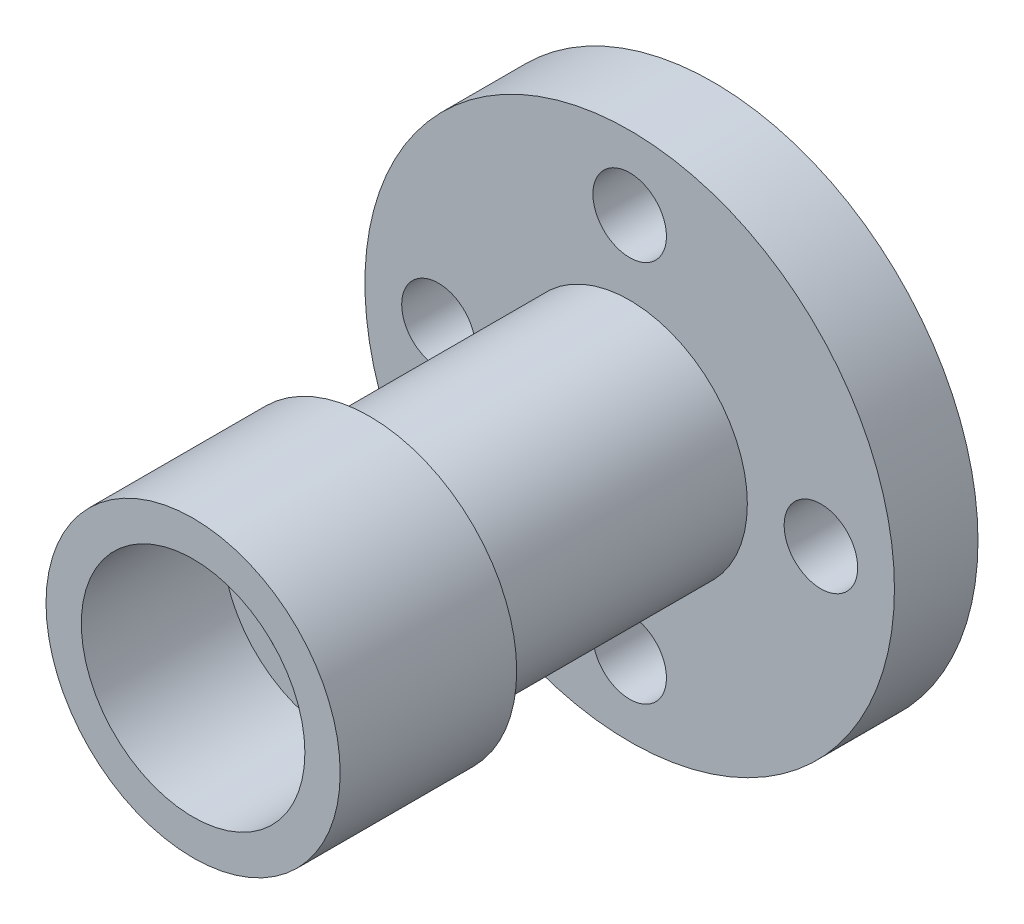
ISO-10303-21;
HEADER;
FILE_DESCRIPTION(('STEP AP214'),'2;1');
FILE_NAME('part.step','',(''),(''),'','','');
FILE_SCHEMA(('AUTOMOTIVE_DESIGN { 1 0 10303 214 1 1 1 1 }'));
ENDSEC;
DATA;
#1=APPLICATION_CONTEXT('core data for automotive mechanical design processes');
#2=APPLICATION_PROTOCOL_DEFINITION('international standard','automotive_design',2000,#1);
#3=PRODUCT_CONTEXT('',#1,'mechanical');
#4=PRODUCT('Part','Part','',(#3));
#5=PRODUCT_RELATED_PRODUCT_CATEGORY('part','',(#4));
#6=PRODUCT_DEFINITION_FORMATION('','',#4);
#7=PRODUCT_DEFINITION_CONTEXT('part definition',#1,'design');
#8=PRODUCT_DEFINITION('design','',#6,#7);
#9=PRODUCT_DEFINITION_SHAPE('','',#8);
#10=(LENGTH_UNIT() NAMED_UNIT(*) SI_UNIT(.MILLI.,.METRE.));
#11=(NAMED_UNIT(*) PLANE_ANGLE_UNIT() SI_UNIT($,.RADIAN.));
#12=(NAMED_UNIT(*) SI_UNIT($,.STERADIAN.) SOLID_ANGLE_UNIT());
#13=UNCERTAINTY_MEASURE_WITH_UNIT(LENGTH_MEASURE(1.E-05),#10,'distance_accuracy_value','');
#14=(GEOMETRIC_REPRESENTATION_CONTEXT(3) GLOBAL_UNCERTAINTY_ASSIGNED_CONTEXT((#13)) GLOBAL_UNIT_ASSIGNED_CONTEXT((#10,
#11,#12)) REPRESENTATION_CONTEXT('',''));
#15=CARTESIAN_POINT('',(0.,0.,0.));
#16=DIRECTION('',(0.,0.,1.));
#17=DIRECTION('',(1.,0.,0.));
#18=AXIS2_PLACEMENT_3D('',#15,#16,#17);
#19=CARTESIAN_POINT('',(0.,0.,14.2));
#20=DIRECTION('',(0.,0.,-1.));
#21=DIRECTION('',(-1.,0.,0.));
#22=AXIS2_PLACEMENT_3D('',#19,#20,#21);
#23=CYLINDRICAL_SURFACE('',#22,45.);
#24=CARTESIAN_POINT('',(0.,0.,14.2));
#25=DIRECTION('',(0.,0.,1.));
#26=DIRECTION('',(1.,0.,0.));
#27=AXIS2_PLACEMENT_3D('',#24,#25,#26);
#28=CIRCLE('',#27,45.);
#29=CARTESIAN_POINT('',(45.,0.,14.2));
#30=VERTEX_POINT('',#29);
#31=EDGE_CURVE('E59',#30,#30,#28,.T.);
#32=ORIENTED_EDGE('',*,*,#31,.F.);
#33=EDGE_LOOP('',(#32));
#34=FACE_BOUND('',#33,.T.);
#35=CARTESIAN_POINT('',(0.,0.,0.));
#36=DIRECTION('',(0.,0.,1.));
#37=DIRECTION('',(1.,0.,0.));
#38=AXIS2_PLACEMENT_3D('',#35,#36,#37);
#39=CIRCLE('',#38,45.);
#40=CARTESIAN_POINT('',(45.,0.,0.));
#41=VERTEX_POINT('',#40);
#42=EDGE_CURVE('E62',#41,#41,#39,.T.);
#43=ORIENTED_EDGE('',*,*,#42,.T.);
#44=EDGE_LOOP('',(#43));
#45=FACE_BOUND('',#44,.T.);
#46=ADVANCED_FACE('F43',(#34,#45),#23,.T.);
#47=CARTESIAN_POINT('',(0.,0.,14.2));
#48=DIRECTION('',(0.,0.,1.));
#49=DIRECTION('',(1.,0.,0.));
#50=AXIS2_PLACEMENT_3D('',#47,#48,#49);
#51=PLANE('',#50);
#52=CARTESIAN_POINT('',(0.,32.5,14.2));
#53=DIRECTION('',(0.,0.,1.));
#54=DIRECTION('',(1.,0.,0.));
#55=AXIS2_PLACEMENT_3D('',#52,#53,#54);
#56=CIRCLE('',#55,6.25);
#57=CARTESIAN_POINT('',(6.25,32.5,14.2));
#58=VERTEX_POINT('',#57);
#59=EDGE_CURVE('E85',#58,#58,#56,.T.);
#60=ORIENTED_EDGE('',*,*,#59,.F.);
#61=EDGE_LOOP('',(#60));
#62=FACE_BOUND('',#61,.T.);
#63=CARTESIAN_POINT('',(-32.5,-1.13473143512402E-13,14.2));
#64=DIRECTION('',(0.,0.,1.));
#65=DIRECTION('',(1.,0.,0.));
#66=AXIS2_PLACEMENT_3D('',#63,#64,#65);
#67=CIRCLE('',#66,6.25);
#68=CARTESIAN_POINT('',(-26.25,-1.13473143512402E-13,14.2));
#69=VERTEX_POINT('',#68);
#70=EDGE_CURVE('E88',#69,#69,#67,.T.);
#71=ORIENTED_EDGE('',*,*,#70,.F.);
#72=EDGE_LOOP('',(#71));
#73=FACE_BOUND('',#72,.T.);
#74=CARTESIAN_POINT('',(2.26946287024804E-13,-32.5,14.2));
#75=DIRECTION('',(0.,0.,1.));
#76=DIRECTION('',(1.,0.,0.));
#77=AXIS2_PLACEMENT_3D('',#74,#75,#76);
#78=CIRCLE('',#77,6.25);
#79=CARTESIAN_POINT('',(6.25000000000023,-32.5,14.2));
#80=VERTEX_POINT('',#79);
#81=EDGE_CURVE('E91',#80,#80,#78,.T.);
#82=ORIENTED_EDGE('',*,*,#81,.F.);
#83=EDGE_LOOP('',(#82));
#84=FACE_BOUND('',#83,.T.);
#85=CARTESIAN_POINT('',(32.5,3.40419430537206E-13,14.2));
#86=DIRECTION('',(0.,0.,1.));
#87=DIRECTION('',(1.,0.,0.));
#88=AXIS2_PLACEMENT_3D('',#85,#86,#87);
#89=CIRCLE('',#88,6.25);
#90=CARTESIAN_POINT('',(38.75,3.40419430537206E-13,14.2));
#91=VERTEX_POINT('',#90);
#92=EDGE_CURVE('E94',#91,#91,#89,.T.);
#93=ORIENTED_EDGE('',*,*,#92,.F.);
#94=EDGE_LOOP('',(#93));
#95=FACE_BOUND('',#94,.T.);
#96=CARTESIAN_POINT('',(0.,0.,14.2));
#97=DIRECTION('',(0.,0.,1.));
#98=DIRECTION('',(1.,0.,0.));
#99=AXIS2_PLACEMENT_3D('',#96,#97,#98);
#100=CIRCLE('',#99,20.);
#101=CARTESIAN_POINT('',(20.,0.,14.2));
#102=VERTEX_POINT('',#101);
#103=EDGE_CURVE('E55',#102,#102,#100,.T.);
#104=ORIENTED_EDGE('',*,*,#103,.F.);
#105=EDGE_LOOP('',(#104));
#106=FACE_BOUND('',#105,.T.);
#107=ORIENTED_EDGE('',*,*,#31,.T.);
#108=EDGE_LOOP('',(#107));
#109=FACE_BOUND('',#108,.T.);
#110=ADVANCED_FACE('F116',(#62,#73,#84,#95,#106,#109),#51,.T.);
#111=CARTESIAN_POINT('',(0.,0.,0.));
#112=DIRECTION('',(0.,0.,1.));
#113=DIRECTION('',(1.,0.,0.));
#114=AXIS2_PLACEMENT_3D('',#111,#112,#113);
#115=PLANE('',#114);
#116=CARTESIAN_POINT('',(0.,32.5,0.));
#117=DIRECTION('',(0.,0.,-1.));
#118=DIRECTION('',(-1.,0.,0.));
#119=AXIS2_PLACEMENT_3D('',#116,#117,#118);
#120=CIRCLE('',#119,6.25);
#121=CARTESIAN_POINT('',(-6.25,32.5,0.));
#122=VERTEX_POINT('',#121);
#123=EDGE_CURVE('E97',#122,#122,#120,.T.);
#124=ORIENTED_EDGE('',*,*,#123,.F.);
#125=EDGE_LOOP('',(#124));
#126=FACE_BOUND('',#125,.T.);
#127=CARTESIAN_POINT('',(-32.5,-1.13473143512402E-13,0.));
#128=DIRECTION('',(0.,0.,-1.));
#129=DIRECTION('',(-1.,0.,0.));
#130=AXIS2_PLACEMENT_3D('',#127,#128,#129);
#131=CIRCLE('',#130,6.25);
#132=CARTESIAN_POINT('',(-38.75,-1.13473143512402E-13,0.));
#133=VERTEX_POINT('',#132);
#134=EDGE_CURVE('E104',#133,#133,#131,.T.);
#135=ORIENTED_EDGE('',*,*,#134,.F.);
#136=EDGE_LOOP('',(#135));
#137=FACE_BOUND('',#136,.T.);
#138=CARTESIAN_POINT('',(2.26946287024804E-13,-32.5,0.));
#139=DIRECTION('',(0.,0.,-1.));
#140=DIRECTION('',(-1.,0.,0.));
#141=AXIS2_PLACEMENT_3D('',#138,#139,#140);
#142=CIRCLE('',#141,6.25);
#143=CARTESIAN_POINT('',(-6.24999999999977,-32.5,0.));
#144=VERTEX_POINT('',#143);
#145=EDGE_CURVE('E101',#144,#144,#142,.T.);
#146=ORIENTED_EDGE('',*,*,#145,.F.);
#147=EDGE_LOOP('',(#146));
#148=FACE_BOUND('',#147,.T.);
#149=CARTESIAN_POINT('',(32.5,3.40419430537206E-13,0.));
#150=DIRECTION('',(0.,0.,-1.));
#151=DIRECTION('',(-1.,0.,0.));
#152=AXIS2_PLACEMENT_3D('',#149,#150,#151);
#153=CIRCLE('',#152,6.25);
#154=CARTESIAN_POINT('',(26.25,3.40419430537206E-13,0.));
#155=VERTEX_POINT('',#154);
#156=EDGE_CURVE('E98',#155,#155,#153,.T.);
#157=ORIENTED_EDGE('',*,*,#156,.F.);
#158=EDGE_LOOP('',(#157));
#159=FACE_BOUND('',#158,.T.);
#160=CARTESIAN_POINT('',(0.,0.,0.));
#161=DIRECTION('',(0.,0.,1.));
#162=DIRECTION('',(1.,0.,0.));
#163=AXIS2_PLACEMENT_3D('',#160,#161,#162);
#164=CIRCLE('',#163,18.);
#165=CARTESIAN_POINT('',(18.,0.,0.));
#166=VERTEX_POINT('',#165);
#167=EDGE_CURVE('E51',#166,#166,#164,.T.);
#168=ORIENTED_EDGE('',*,*,#167,.T.);
#169=EDGE_LOOP('',(#168));
#170=FACE_BOUND('',#169,.T.);
#171=ORIENTED_EDGE('',*,*,#42,.F.);
#172=EDGE_LOOP('',(#171));
#173=FACE_BOUND('',#172,.T.);
#174=ADVANCED_FACE('F112',(#126,#137,#148,#159,#170,#173),#115,.F.);
#175=CARTESIAN_POINT('',(0.,0.,58.4));
#176=DIRECTION('',(0.,0.,-1.));
#177=DIRECTION('',(-1.,0.,0.));
#178=AXIS2_PLACEMENT_3D('',#175,#176,#177);
#179=CYLINDRICAL_SURFACE('',#178,20.);
#180=CARTESIAN_POINT('',(0.,0.,58.4));
#181=DIRECTION('',(0.,0.,1.));
#182=DIRECTION('',(1.,0.,0.));
#183=AXIS2_PLACEMENT_3D('',#180,#181,#182);
#184=CIRCLE('',#183,20.);
#185=CARTESIAN_POINT('',(20.,0.,58.4));
#186=VERTEX_POINT('',#185);
#187=EDGE_CURVE('E65',#186,#186,#184,.T.);
#188=ORIENTED_EDGE('',*,*,#187,.F.);
#189=EDGE_LOOP('',(#188));
#190=FACE_BOUND('',#189,.T.);
#191=ORIENTED_EDGE('',*,*,#103,.T.);
#192=EDGE_LOOP('',(#191));
#193=FACE_BOUND('',#192,.T.);
#194=ADVANCED_FACE('F115',(#190,#193),#179,.T.);
#195=CARTESIAN_POINT('',(0.,0.,88.4));
#196=DIRECTION('',(0.,0.,-1.));
#197=DIRECTION('',(-1.,0.,0.));
#198=AXIS2_PLACEMENT_3D('',#195,#196,#197);
#199=CYLINDRICAL_SURFACE('',#198,25.);
#200=CARTESIAN_POINT('',(0.,0.,88.4));
#201=DIRECTION('',(0.,0.,1.));
#202=DIRECTION('',(1.,0.,0.));
#203=AXIS2_PLACEMENT_3D('',#200,#201,#202);
#204=CIRCLE('',#203,25.);
#205=CARTESIAN_POINT('',(25.,0.,88.4));
#206=VERTEX_POINT('',#205);
#207=EDGE_CURVE('E70',#206,#206,#204,.T.);
#208=ORIENTED_EDGE('',*,*,#207,.F.);
#209=EDGE_LOOP('',(#208));
#210=FACE_BOUND('',#209,.T.);
#211=CARTESIAN_POINT('',(0.,0.,58.4));
#212=DIRECTION('',(0.,0.,1.));
#213=DIRECTION('',(1.,0.,0.));
#214=AXIS2_PLACEMENT_3D('',#211,#212,#213);
#215=CIRCLE('',#214,25.);
#216=CARTESIAN_POINT('',(25.,0.,58.4));
#217=VERTEX_POINT('',#216);
#218=EDGE_CURVE('E71',#217,#217,#215,.T.);
#219=ORIENTED_EDGE('',*,*,#218,.T.);
#220=EDGE_LOOP('',(#219));
#221=FACE_BOUND('',#220,.T.);
#222=ADVANCED_FACE('F137',(#210,#221),#199,.T.);
#223=CARTESIAN_POINT('',(0.,0.,88.4));
#224=DIRECTION('',(0.,0.,1.));
#225=DIRECTION('',(1.,0.,0.));
#226=AXIS2_PLACEMENT_3D('',#223,#224,#225);
#227=PLANE('',#226);
#228=CARTESIAN_POINT('',(0.,0.,88.4));
#229=DIRECTION('',(0.,0.,1.));
#230=DIRECTION('',(1.,0.,0.));
#231=AXIS2_PLACEMENT_3D('',#228,#229,#230);
#232=CIRCLE('',#231,19.);
#233=CARTESIAN_POINT('',(19.,0.,88.4));
#234=VERTEX_POINT('',#233);
#235=EDGE_CURVE('E77',#234,#234,#232,.T.);
#236=ORIENTED_EDGE('',*,*,#235,.F.);
#237=EDGE_LOOP('',(#236));
#238=FACE_BOUND('',#237,.T.);
#239=ORIENTED_EDGE('',*,*,#207,.T.);
#240=EDGE_LOOP('',(#239));
#241=FACE_BOUND('',#240,.T.);
#242=ADVANCED_FACE('F141',(#238,#241),#227,.T.);
#243=CARTESIAN_POINT('',(0.,0.,58.4));
#244=DIRECTION('',(0.,0.,1.));
#245=DIRECTION('',(1.,0.,0.));
#246=AXIS2_PLACEMENT_3D('',#243,#244,#245);
#247=PLANE('',#246);
#248=ORIENTED_EDGE('',*,*,#187,.T.);
#249=EDGE_LOOP('',(#248));
#250=FACE_BOUND('',#249,.T.);
#251=ORIENTED_EDGE('',*,*,#218,.F.);
#252=EDGE_LOOP('',(#251));
#253=FACE_BOUND('',#252,.T.);
#254=ADVANCED_FACE('F143',(#250,#253),#247,.F.);
#255=CARTESIAN_POINT('',(0.,0.,64.4));
#256=DIRECTION('',(0.,0.,1.));
#257=DIRECTION('',(1.,0.,0.));
#258=AXIS2_PLACEMENT_3D('',#255,#256,#257);
#259=CYLINDRICAL_SURFACE('',#258,19.);
#260=CARTESIAN_POINT('',(0.,0.,64.4));
#261=DIRECTION('',(0.,0.,1.));
#262=DIRECTION('',(1.,0.,0.));
#263=AXIS2_PLACEMENT_3D('',#260,#261,#262);
#264=CIRCLE('',#263,19.);
#265=CARTESIAN_POINT('',(19.,0.,64.4));
#266=VERTEX_POINT('',#265);
#267=EDGE_CURVE('E74',#266,#266,#264,.T.);
#268=ORIENTED_EDGE('',*,*,#267,.F.);
#269=EDGE_LOOP('',(#268));
#270=FACE_BOUND('',#269,.T.);
#271=ORIENTED_EDGE('',*,*,#235,.T.);
#272=EDGE_LOOP('',(#271));
#273=FACE_BOUND('',#272,.T.);
#274=ADVANCED_FACE('F146',(#270,#273),#259,.F.);
#275=CARTESIAN_POINT('',(0.,0.,64.4));
#276=DIRECTION('',(0.,0.,1.));
#277=DIRECTION('',(1.,0.,0.));
#278=AXIS2_PLACEMENT_3D('',#275,#276,#277);
#279=PLANE('',#278);
#280=CARTESIAN_POINT('',(0.,0.,64.4));
#281=DIRECTION('',(0.,0.,1.));
#282=DIRECTION('',(1.,0.,0.));
#283=AXIS2_PLACEMENT_3D('',#280,#281,#282);
#284=CIRCLE('',#283,15.);
#285=CARTESIAN_POINT('',(15.,0.,64.4));
#286=VERTEX_POINT('',#285);
#287=EDGE_CURVE('E80',#286,#286,#284,.T.);
#288=ORIENTED_EDGE('',*,*,#287,.F.);
#289=EDGE_LOOP('',(#288));
#290=FACE_BOUND('',#289,.T.);
#291=ORIENTED_EDGE('',*,*,#267,.T.);
#292=EDGE_LOOP('',(#291));
#293=FACE_BOUND('',#292,.T.);
#294=ADVANCED_FACE('F153',(#290,#293),#279,.T.);
#295=CARTESIAN_POINT('',(0.,0.,-19.6));
#296=DIRECTION('',(0.,0.,1.));
#297=DIRECTION('',(1.,0.,0.));
#298=AXIS2_PLACEMENT_3D('',#295,#296,#297);
#299=CYLINDRICAL_SURFACE('',#298,15.);
#300=CARTESIAN_POINT('',(0.,0.,3.50000000000002));
#301=DIRECTION('',(0.,0.,1.));
#302=DIRECTION('',(1.,0.,0.));
#303=AXIS2_PLACEMENT_3D('',#300,#301,#302);
#304=CIRCLE('',#303,15.);
#305=CARTESIAN_POINT('',(15.,0.,3.50000000000002));
#306=VERTEX_POINT('',#305);
#307=EDGE_CURVE('E10',#306,#306,#304,.F.);
#308=ORIENTED_EDGE('',*,*,#307,.T.);
#309=EDGE_LOOP('',(#308));
#310=FACE_BOUND('',#309,.T.);
#311=ORIENTED_EDGE('',*,*,#287,.T.);
#312=EDGE_LOOP('',(#311));
#313=FACE_BOUND('',#312,.T.);
#314=ADVANCED_FACE('F157',(#310,#313),#299,.F.);
#315=CARTESIAN_POINT('',(0.,0.,0.));
#316=DIRECTION('',(0.,0.,-1.));
#317=DIRECTION('',(-1.,0.,0.));
#318=AXIS2_PLACEMENT_3D('',#315,#316,#317);
#319=CONICAL_SURFACE('',#318,18.,0.70862627212767);
#320=ORIENTED_EDGE('',*,*,#307,.F.);
#321=EDGE_LOOP('',(#320));
#322=FACE_BOUND('',#321,.T.);
#323=ORIENTED_EDGE('',*,*,#167,.F.);
#324=EDGE_LOOP('',(#323));
#325=FACE_BOUND('',#324,.T.);
#326=ADVANCED_FACE('F46',(#322,#325),#319,.F.);
#327=CARTESIAN_POINT('',(32.5,3.40419430537206E-13,84.));
#328=DIRECTION('',(0.,0.,-1.));
#329=DIRECTION('',(-1.,0.,0.));
#330=AXIS2_PLACEMENT_3D('',#327,#328,#329);
#331=CYLINDRICAL_SURFACE('',#330,6.25);
#332=ORIENTED_EDGE('',*,*,#92,.T.);
#333=EDGE_LOOP('',(#332));
#334=FACE_BOUND('',#333,.T.);
#335=ORIENTED_EDGE('',*,*,#156,.T.);
#336=EDGE_LOOP('',(#335));
#337=FACE_BOUND('',#336,.T.);
#338=ADVANCED_FACE('F161',(#334,#337),#331,.F.);
#339=CARTESIAN_POINT('',(2.26946287024804E-13,-32.5,84.));
#340=DIRECTION('',(0.,0.,-1.));
#341=DIRECTION('',(-1.,0.,0.));
#342=AXIS2_PLACEMENT_3D('',#339,#340,#341);
#343=CYLINDRICAL_SURFACE('',#342,6.25);
#344=ORIENTED_EDGE('',*,*,#81,.T.);
#345=EDGE_LOOP('',(#344));
#346=FACE_BOUND('',#345,.T.);
#347=ORIENTED_EDGE('',*,*,#145,.T.);
#348=EDGE_LOOP('',(#347));
#349=FACE_BOUND('',#348,.T.);
#350=ADVANCED_FACE('F164',(#346,#349),#343,.F.);
#351=CARTESIAN_POINT('',(-32.5,-1.13473143512402E-13,84.));
#352=DIRECTION('',(0.,0.,-1.));
#353=DIRECTION('',(-1.,0.,0.));
#354=AXIS2_PLACEMENT_3D('',#351,#352,#353);
#355=CYLINDRICAL_SURFACE('',#354,6.25);
#356=ORIENTED_EDGE('',*,*,#70,.T.);
#357=EDGE_LOOP('',(#356));
#358=FACE_BOUND('',#357,.T.);
#359=ORIENTED_EDGE('',*,*,#134,.T.);
#360=EDGE_LOOP('',(#359));
#361=FACE_BOUND('',#360,.T.);
#362=ADVANCED_FACE('F168',(#358,#361),#355,.F.);
#363=CARTESIAN_POINT('',(0.,32.5,84.));
#364=DIRECTION('',(0.,0.,-1.));
#365=DIRECTION('',(-1.,0.,0.));
#366=AXIS2_PLACEMENT_3D('',#363,#364,#365);
#367=CYLINDRICAL_SURFACE('',#366,6.25);
#368=ORIENTED_EDGE('',*,*,#59,.T.);
#369=EDGE_LOOP('',(#368));
#370=FACE_BOUND('',#369,.T.);
#371=ORIENTED_EDGE('',*,*,#123,.T.);
#372=EDGE_LOOP('',(#371));
#373=FACE_BOUND('',#372,.T.);
#374=ADVANCED_FACE('F110',(#370,#373),#367,.F.);
#375=CLOSED_SHELL('',(#46,#110,#174,#194,#222,#242,#254,#274,#294,#314,#326,#338,#350,#362,#374));
#376=MANIFOLD_SOLID_BREP('B2',#375);
#377=ADVANCED_BREP_SHAPE_REPRESENTATION('',(#18,#376),#14);
#378=SHAPE_DEFINITION_REPRESENTATION(#9,#377);
ENDSEC;
END-ISO-10303-21;
